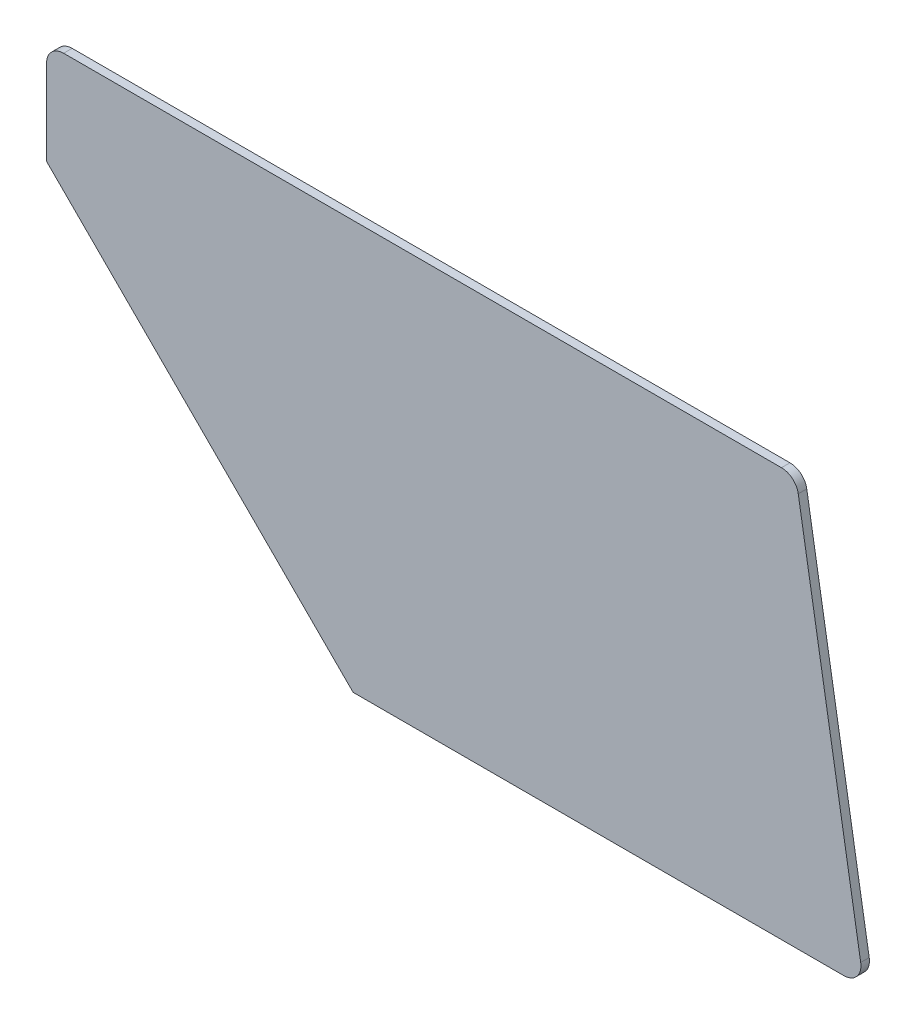
ISO-10303-21;
HEADER;
FILE_DESCRIPTION(('STEP AP214'),'2;1');
FILE_NAME('part.step','',(''),(''),'','','');
FILE_SCHEMA(('AUTOMOTIVE_DESIGN { 1 0 10303 214 1 1 1 1 }'));
ENDSEC;
DATA;
#1=APPLICATION_CONTEXT('core data for automotive mechanical design processes');
#2=APPLICATION_PROTOCOL_DEFINITION('international standard','automotive_design',2000,#1);
#3=PRODUCT_CONTEXT('',#1,'mechanical');
#4=PRODUCT('Part','Part','',(#3));
#5=PRODUCT_RELATED_PRODUCT_CATEGORY('part','',(#4));
#6=PRODUCT_DEFINITION_FORMATION('','',#4);
#7=PRODUCT_DEFINITION_CONTEXT('part definition',#1,'design');
#8=PRODUCT_DEFINITION('design','',#6,#7);
#9=PRODUCT_DEFINITION_SHAPE('','',#8);
#10=(LENGTH_UNIT() NAMED_UNIT(*) SI_UNIT(.MILLI.,.METRE.));
#11=(NAMED_UNIT(*) PLANE_ANGLE_UNIT() SI_UNIT($,.RADIAN.));
#12=(NAMED_UNIT(*) SI_UNIT($,.STERADIAN.) SOLID_ANGLE_UNIT());
#13=UNCERTAINTY_MEASURE_WITH_UNIT(LENGTH_MEASURE(1.E-05),#10,'distance_accuracy_value','');
#14=(GEOMETRIC_REPRESENTATION_CONTEXT(3) GLOBAL_UNCERTAINTY_ASSIGNED_CONTEXT((#13)) GLOBAL_UNIT_ASSIGNED_CONTEXT((#10,
#11,#12)) REPRESENTATION_CONTEXT('',''));
#15=CARTESIAN_POINT('',(0.,0.,0.));
#16=DIRECTION('',(0.,0.,1.));
#17=DIRECTION('',(1.,0.,0.));
#18=AXIS2_PLACEMENT_3D('',#15,#16,#17);
#19=CARTESIAN_POINT('',(131.468757514709,-44.216801490356,0.));
#20=DIRECTION('',(0.,0.,1.));
#21=DIRECTION('',(1.,0.,0.));
#22=AXIS2_PLACEMENT_3D('',#19,#20,#21);
#23=PLANE('',#22);
#24=CARTESIAN_POINT('',(-23.5242133913176,18.4927677344659,0.));
#25=DIRECTION('',(0.,0.,1.));
#26=DIRECTION('',(1.,0.,0.));
#27=AXIS2_PLACEMENT_3D('',#24,#25,#26);
#28=CIRCLE('',#27,6.34999999999995);
#29=CARTESIAN_POINT('',(-23.5242133913175,24.8427677344659,0.));
#30=VERTEX_POINT('',#29);
#31=CARTESIAN_POINT('',(-29.8742133913176,18.4927677344659,0.));
#32=VERTEX_POINT('',#31);
#33=EDGE_CURVE('E20',#30,#32,#28,.T.);
#34=ORIENTED_EDGE('',*,*,#33,.F.);
#35=DIRECTION('',(1.,0.,0.));
#36=VECTOR('',#35,1.);
#37=CARTESIAN_POINT('',(-23.5242133913175,24.8427677344659,0.));
#38=LINE('',#37,#36);
#39=CARTESIAN_POINT('',(244.14652959745,24.8427677344659,0.));
#40=VERTEX_POINT('',#39);
#41=EDGE_CURVE('E136',#40,#30,#38,.F.);
#42=ORIENTED_EDGE('',*,*,#41,.F.);
#43=CARTESIAN_POINT('',(244.14652959745,18.4927677344658,0.));
#44=DIRECTION('',(0.,0.,1.));
#45=DIRECTION('',(1.,0.,0.));
#46=AXIS2_PLACEMENT_3D('',#43,#44,#45);
#47=CIRCLE('',#46,6.35000000000015);
#48=CARTESIAN_POINT('',(250.410131013784,19.5367013038549,0.));
#49=VERTEX_POINT('',#48);
#50=EDGE_CURVE('E150',#49,#40,#47,.T.);
#51=ORIENTED_EDGE('',*,*,#50,.F.);
#52=DIRECTION('',(-0.164398987305357,0.986393923832144,0.));
#53=VECTOR('',#52,1.);
#54=CARTESIAN_POINT('',(250.410131013784,19.5367013038549,0.));
#55=LINE('',#54,#53);
#56=CARTESIAN_POINT('',(273.693464347117,-120.163298696145,0.));
#57=VERTEX_POINT('',#56);
#58=EDGE_CURVE('E133',#57,#49,#55,.T.);
#59=ORIENTED_EDGE('',*,*,#58,.F.);
#60=CARTESIAN_POINT('',(267.429862930784,-121.207232265534,0.));
#61=DIRECTION('',(0.,0.,1.));
#62=DIRECTION('',(1.,0.,0.));
#63=AXIS2_PLACEMENT_3D('',#60,#61,#62);
#64=CIRCLE('',#63,6.35);
#65=CARTESIAN_POINT('',(267.429862930784,-127.557232265534,0.));
#66=VERTEX_POINT('',#65);
#67=EDGE_CURVE('E98',#66,#57,#64,.T.);
#68=ORIENTED_EDGE('',*,*,#67,.F.);
#69=DIRECTION('',(1.,0.,0.));
#70=VECTOR('',#69,1.);
#71=CARTESIAN_POINT('',(267.429862930784,-127.557232265534,0.));
#72=LINE('',#71,#70);
#73=CARTESIAN_POINT('',(84.4257866086824,-127.557232265534,0.));
#74=VERTEX_POINT('',#73);
#75=EDGE_CURVE('E82',#74,#66,#72,.T.);
#76=ORIENTED_EDGE('',*,*,#75,.F.);
#77=DIRECTION('',(0.707106781186547,-0.707106781186548,0.));
#78=VECTOR('',#77,1.);
#79=CARTESIAN_POINT('',(84.4257866086824,-127.557232265534,0.));
#80=LINE('',#79,#78);
#81=CARTESIAN_POINT('',(-29.8742133913175,-13.257232265534,0.));
#82=VERTEX_POINT('',#81);
#83=EDGE_CURVE('E80',#82,#74,#80,.T.);
#84=ORIENTED_EDGE('',*,*,#83,.F.);
#85=DIRECTION('',(0.,1.,0.));
#86=VECTOR('',#85,1.);
#87=CARTESIAN_POINT('',(-29.8742133913176,-13.2572322655341,0.));
#88=LINE('',#87,#86);
#89=EDGE_CURVE('E77',#32,#82,#88,.F.);
#90=ORIENTED_EDGE('',*,*,#89,.F.);
#91=EDGE_LOOP('',(#34,#42,#51,#59,#68,#76,#84,#90));
#92=FACE_BOUND('',#91,.T.);
#93=ADVANCED_FACE('F17',(#92),#23,.F.);
#94=CARTESIAN_POINT('',(-23.5242133913175,24.8427677344659,0.));
#95=DIRECTION('',(0.,1.,0.));
#96=DIRECTION('',(0.,0.,1.));
#97=AXIS2_PLACEMENT_3D('',#94,#95,#96);
#98=PLANE('',#97);
#99=DIRECTION('',(1.,0.,0.));
#100=VECTOR('',#99,1.);
#101=CARTESIAN_POINT('',(131.468757514709,24.8427677344659,3.175));
#102=LINE('',#101,#100);
#103=CARTESIAN_POINT('',(244.14652959745,24.8427677344659,3.175));
#104=VERTEX_POINT('',#103);
#105=CARTESIAN_POINT('',(-23.5242133913175,24.8427677344659,3.175));
#106=VERTEX_POINT('',#105);
#107=EDGE_CURVE('E149',#104,#106,#102,.F.);
#108=ORIENTED_EDGE('',*,*,#107,.F.);
#109=DIRECTION('',(0.,0.,1.));
#110=VECTOR('',#109,1.);
#111=CARTESIAN_POINT('',(244.14652959745,24.842767734466,0.));
#112=LINE('',#111,#110);
#113=EDGE_CURVE('E152',#40,#104,#112,.T.);
#114=ORIENTED_EDGE('',*,*,#113,.F.);
#115=ORIENTED_EDGE('',*,*,#41,.T.);
#116=DIRECTION('',(0.,0.,1.));
#117=VECTOR('',#116,1.);
#118=CARTESIAN_POINT('',(-23.5242133913175,24.8427677344659,0.));
#119=LINE('',#118,#117);
#120=EDGE_CURVE('E130',#106,#30,#119,.F.);
#121=ORIENTED_EDGE('',*,*,#120,.F.);
#122=EDGE_LOOP('',(#108,#114,#115,#121));
#123=FACE_BOUND('',#122,.T.);
#124=ADVANCED_FACE('F191',(#123),#98,.T.);
#125=CARTESIAN_POINT('',(-23.5242133913176,18.4927677344659,0.));
#126=DIRECTION('',(0.,0.,1.));
#127=DIRECTION('',(1.,0.,0.));
#128=AXIS2_PLACEMENT_3D('',#125,#126,#127);
#129=CYLINDRICAL_SURFACE('',#128,6.34999999999995);
#130=CARTESIAN_POINT('',(-23.5242133913176,18.4927677344659,3.175));
#131=DIRECTION('',(0.,0.,1.));
#132=DIRECTION('',(1.,0.,0.));
#133=AXIS2_PLACEMENT_3D('',#130,#131,#132);
#134=CIRCLE('',#133,6.34999999999995);
#135=CARTESIAN_POINT('',(-29.8742133913175,18.4927677344659,3.175));
#136=VERTEX_POINT('',#135);
#137=EDGE_CURVE('E116',#106,#136,#134,.T.);
#138=ORIENTED_EDGE('',*,*,#137,.F.);
#139=ORIENTED_EDGE('',*,*,#120,.T.);
#140=ORIENTED_EDGE('',*,*,#33,.T.);
#141=DIRECTION('',(0.,0.,1.));
#142=VECTOR('',#141,1.);
#143=CARTESIAN_POINT('',(-29.8742133913176,18.4927677344659,0.));
#144=LINE('',#143,#142);
#145=EDGE_CURVE('E127',#136,#32,#144,.F.);
#146=ORIENTED_EDGE('',*,*,#145,.F.);
#147=EDGE_LOOP('',(#138,#139,#140,#146));
#148=FACE_BOUND('',#147,.T.);
#149=ADVANCED_FACE('F194',(#148),#129,.T.);
#150=CARTESIAN_POINT('',(-29.8742133913176,-13.2572322655341,0.));
#151=DIRECTION('',(-1.,0.,0.));
#152=DIRECTION('',(0.,0.,1.));
#153=AXIS2_PLACEMENT_3D('',#150,#151,#152);
#154=PLANE('',#153);
#155=DIRECTION('',(0.,1.,0.));
#156=VECTOR('',#155,1.);
#157=CARTESIAN_POINT('',(-29.8742133913175,-44.216801490356,3.175));
#158=LINE('',#157,#156);
#159=CARTESIAN_POINT('',(-29.8742133913175,-13.2572322655341,3.175));
#160=VERTEX_POINT('',#159);
#161=EDGE_CURVE('E114',#136,#160,#158,.F.);
#162=ORIENTED_EDGE('',*,*,#161,.F.);
#163=ORIENTED_EDGE('',*,*,#145,.T.);
#164=ORIENTED_EDGE('',*,*,#89,.T.);
#165=DIRECTION('',(0.,0.,1.));
#166=VECTOR('',#165,1.);
#167=CARTESIAN_POINT('',(-29.8742133913175,-13.257232265534,0.));
#168=LINE('',#167,#166);
#169=EDGE_CURVE('E123',#160,#82,#168,.F.);
#170=ORIENTED_EDGE('',*,*,#169,.F.);
#171=EDGE_LOOP('',(#162,#163,#164,#170));
#172=FACE_BOUND('',#171,.T.);
#173=ADVANCED_FACE('F196',(#172),#154,.T.);
#174=CARTESIAN_POINT('',(84.4257866086824,-127.557232265534,0.));
#175=DIRECTION('',(-0.707106781186548,-0.707106781186547,0.));
#176=DIRECTION('',(0.707106781186547,-0.707106781186548,0.));
#177=AXIS2_PLACEMENT_3D('',#174,#175,#176);
#178=PLANE('',#177);
#179=DIRECTION('',(0.707106781186548,-0.707106781186547,0.));
#180=VECTOR('',#179,1.);
#181=CARTESIAN_POINT('',(-29.8742133913176,-13.2572322655341,3.175));
#182=LINE('',#181,#180);
#183=CARTESIAN_POINT('',(84.4257866086824,-127.557232265534,3.175));
#184=VERTEX_POINT('',#183);
#185=EDGE_CURVE('E95',#160,#184,#182,.T.);
#186=ORIENTED_EDGE('',*,*,#185,.F.);
#187=ORIENTED_EDGE('',*,*,#169,.T.);
#188=ORIENTED_EDGE('',*,*,#83,.T.);
#189=DIRECTION('',(0.,0.,-1.));
#190=VECTOR('',#189,1.);
#191=CARTESIAN_POINT('',(84.4257866086824,-127.557232265534,0.));
#192=LINE('',#191,#190);
#193=EDGE_CURVE('E90',#184,#74,#192,.T.);
#194=ORIENTED_EDGE('',*,*,#193,.F.);
#195=EDGE_LOOP('',(#186,#187,#188,#194));
#196=FACE_BOUND('',#195,.T.);
#197=ADVANCED_FACE('F92',(#196),#178,.T.);
#198=CARTESIAN_POINT('',(267.429862930784,-127.557232265534,0.));
#199=DIRECTION('',(0.,-1.,0.));
#200=DIRECTION('',(0.,0.,-1.));
#201=AXIS2_PLACEMENT_3D('',#198,#199,#200);
#202=PLANE('',#201);
#203=DIRECTION('',(1.,0.,0.));
#204=VECTOR('',#203,1.);
#205=CARTESIAN_POINT('',(131.468757514709,-127.557232265534,3.175));
#206=LINE('',#205,#204);
#207=CARTESIAN_POINT('',(267.429862930784,-127.557232265534,3.175));
#208=VERTEX_POINT('',#207);
#209=EDGE_CURVE('E101',#184,#208,#206,.T.);
#210=ORIENTED_EDGE('',*,*,#209,.F.);
#211=ORIENTED_EDGE('',*,*,#193,.T.);
#212=ORIENTED_EDGE('',*,*,#75,.T.);
#213=DIRECTION('',(0.,0.,1.));
#214=VECTOR('',#213,1.);
#215=CARTESIAN_POINT('',(267.429862930784,-127.557232265534,0.));
#216=LINE('',#215,#214);
#217=EDGE_CURVE('E104',#208,#66,#216,.F.);
#218=ORIENTED_EDGE('',*,*,#217,.F.);
#219=EDGE_LOOP('',(#210,#211,#212,#218));
#220=FACE_BOUND('',#219,.T.);
#221=ADVANCED_FACE('F102',(#220),#202,.T.);
#222=CARTESIAN_POINT('',(267.429862930784,-121.207232265534,0.));
#223=DIRECTION('',(0.,0.,1.));
#224=DIRECTION('',(1.,0.,0.));
#225=AXIS2_PLACEMENT_3D('',#222,#223,#224);
#226=CYLINDRICAL_SURFACE('',#225,6.35);
#227=CARTESIAN_POINT('',(267.429862930784,-121.207232265534,3.175));
#228=DIRECTION('',(0.,0.,1.));
#229=DIRECTION('',(1.,0.,0.));
#230=AXIS2_PLACEMENT_3D('',#227,#228,#229);
#231=CIRCLE('',#230,6.35);
#232=CARTESIAN_POINT('',(273.693464347118,-120.163298696145,3.175));
#233=VERTEX_POINT('',#232);
#234=EDGE_CURVE('E108',#208,#233,#231,.T.);
#235=ORIENTED_EDGE('',*,*,#234,.F.);
#236=ORIENTED_EDGE('',*,*,#217,.T.);
#237=ORIENTED_EDGE('',*,*,#67,.T.);
#238=DIRECTION('',(0.,0.,1.));
#239=VECTOR('',#238,1.);
#240=CARTESIAN_POINT('',(273.693464347117,-120.163298696145,0.));
#241=LINE('',#240,#239);
#242=EDGE_CURVE('E135',#233,#57,#241,.F.);
#243=ORIENTED_EDGE('',*,*,#242,.F.);
#244=EDGE_LOOP('',(#235,#236,#237,#243));
#245=FACE_BOUND('',#244,.T.);
#246=ADVANCED_FACE('F169',(#245),#226,.T.);
#247=CARTESIAN_POINT('',(250.410131013784,19.5367013038549,0.));
#248=DIRECTION('',(0.986393923832144,0.164398987305357,0.));
#249=DIRECTION('',(-0.164398987305357,0.986393923832144,0.));
#250=AXIS2_PLACEMENT_3D('',#247,#248,#249);
#251=PLANE('',#250);
#252=DIRECTION('',(-0.164398987305362,0.986393923832143,0.));
#253=VECTOR('',#252,1.);
#254=CARTESIAN_POINT('',(273.693464347118,-120.163298696145,3.175));
#255=LINE('',#254,#253);
#256=CARTESIAN_POINT('',(250.410131013784,19.5367013038549,3.175));
#257=VERTEX_POINT('',#256);
#258=EDGE_CURVE('E26',#233,#257,#255,.T.);
#259=ORIENTED_EDGE('',*,*,#258,.F.);
#260=ORIENTED_EDGE('',*,*,#242,.T.);
#261=ORIENTED_EDGE('',*,*,#58,.T.);
#262=DIRECTION('',(0.,0.,1.));
#263=VECTOR('',#262,1.);
#264=CARTESIAN_POINT('',(250.410131013784,19.5367013038549,0.));
#265=LINE('',#264,#263);
#266=EDGE_CURVE('E35',#257,#49,#265,.F.);
#267=ORIENTED_EDGE('',*,*,#266,.F.);
#268=EDGE_LOOP('',(#259,#260,#261,#267));
#269=FACE_BOUND('',#268,.T.);
#270=ADVANCED_FACE('F168',(#269),#251,.T.);
#271=CARTESIAN_POINT('',(244.14652959745,18.4927677344658,0.));
#272=DIRECTION('',(0.,0.,1.));
#273=DIRECTION('',(1.,0.,0.));
#274=AXIS2_PLACEMENT_3D('',#271,#272,#273);
#275=CYLINDRICAL_SURFACE('',#274,6.35000000000015);
#276=CARTESIAN_POINT('',(244.14652959745,18.4927677344658,3.175));
#277=DIRECTION('',(0.,0.,1.));
#278=DIRECTION('',(1.,0.,0.));
#279=AXIS2_PLACEMENT_3D('',#276,#277,#278);
#280=CIRCLE('',#279,6.35000000000015);
#281=EDGE_CURVE('E11',#257,#104,#280,.T.);
#282=ORIENTED_EDGE('',*,*,#281,.F.);
#283=ORIENTED_EDGE('',*,*,#266,.T.);
#284=ORIENTED_EDGE('',*,*,#50,.T.);
#285=ORIENTED_EDGE('',*,*,#113,.T.);
#286=EDGE_LOOP('',(#282,#283,#284,#285));
#287=FACE_BOUND('',#286,.T.);
#288=ADVANCED_FACE('F177',(#287),#275,.T.);
#289=CARTESIAN_POINT('',(131.468757514709,-44.216801490356,3.175));
#290=DIRECTION('',(0.,0.,1.));
#291=DIRECTION('',(1.,0.,0.));
#292=AXIS2_PLACEMENT_3D('',#289,#290,#291);
#293=PLANE('',#292);
#294=ORIENTED_EDGE('',*,*,#258,.T.);
#295=ORIENTED_EDGE('',*,*,#281,.T.);
#296=ORIENTED_EDGE('',*,*,#107,.T.);
#297=ORIENTED_EDGE('',*,*,#137,.T.);
#298=ORIENTED_EDGE('',*,*,#161,.T.);
#299=ORIENTED_EDGE('',*,*,#185,.T.);
#300=ORIENTED_EDGE('',*,*,#209,.T.);
#301=ORIENTED_EDGE('',*,*,#234,.T.);
#302=EDGE_LOOP('',(#294,#295,#296,#297,#298,#299,#300,#301));
#303=FACE_BOUND('',#302,.T.);
#304=ADVANCED_FACE('F111',(#303),#293,.T.);
#305=CLOSED_SHELL('',(#93,#124,#149,#173,#197,#221,#246,#270,#288,#304));
#306=MANIFOLD_SOLID_BREP('B1',#305);
#307=ADVANCED_BREP_SHAPE_REPRESENTATION('',(#18,#306),#14);
#308=SHAPE_DEFINITION_REPRESENTATION(#9,#307);
ENDSEC;
END-ISO-10303-21;
